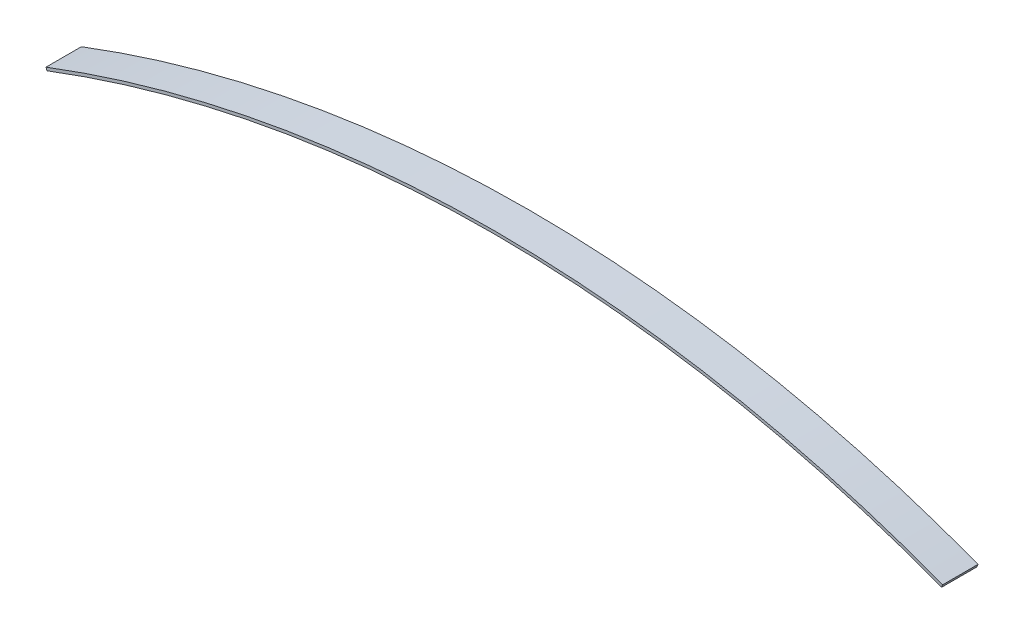
ISO-10303-21;
HEADER;
FILE_DESCRIPTION(('STEP AP214'),'2;1');
FILE_NAME('part.step','',(''),(''),'','','');
FILE_SCHEMA(('AUTOMOTIVE_DESIGN { 1 0 10303 214 1 1 1 1 }'));
ENDSEC;
DATA;
#1=APPLICATION_CONTEXT('core data for automotive mechanical design processes');
#2=APPLICATION_PROTOCOL_DEFINITION('international standard','automotive_design',2000,#1);
#3=PRODUCT_CONTEXT('',#1,'mechanical');
#4=PRODUCT('Part','Part','',(#3));
#5=PRODUCT_RELATED_PRODUCT_CATEGORY('part','',(#4));
#6=PRODUCT_DEFINITION_FORMATION('','',#4);
#7=PRODUCT_DEFINITION_CONTEXT('part definition',#1,'design');
#8=PRODUCT_DEFINITION('design','',#6,#7);
#9=PRODUCT_DEFINITION_SHAPE('','',#8);
#10=(LENGTH_UNIT() NAMED_UNIT(*) SI_UNIT(.MILLI.,.METRE.));
#11=(NAMED_UNIT(*) PLANE_ANGLE_UNIT() SI_UNIT($,.RADIAN.));
#12=(NAMED_UNIT(*) SI_UNIT($,.STERADIAN.) SOLID_ANGLE_UNIT());
#13=UNCERTAINTY_MEASURE_WITH_UNIT(LENGTH_MEASURE(1.E-05),#10,'distance_accuracy_value','');
#14=(GEOMETRIC_REPRESENTATION_CONTEXT(3) GLOBAL_UNCERTAINTY_ASSIGNED_CONTEXT((#13)) GLOBAL_UNIT_ASSIGNED_CONTEXT((#10,
#11,#12)) REPRESENTATION_CONTEXT('',''));
#15=CARTESIAN_POINT('',(0.,0.,0.));
#16=DIRECTION('',(0.,0.,1.));
#17=DIRECTION('',(1.,0.,0.));
#18=AXIS2_PLACEMENT_3D('',#15,#16,#17);
#19=CARTESIAN_POINT('',(0.,0.,0.));
#20=DIRECTION('',(0.,0.,1.));
#21=DIRECTION('',(1.,0.,0.));
#22=AXIS2_PLACEMENT_3D('',#19,#20,#21);
#23=CYLINDRICAL_SURFACE('',#22,2805.8);
#24=CARTESIAN_POINT('',(0.,0.,39.5));
#25=DIRECTION('',(0.,0.,1.));
#26=DIRECTION('',(1.,0.,0.));
#27=AXIS2_PLACEMENT_3D('',#24,#25,#26);
#28=CIRCLE('',#27,2805.8);
#29=CARTESIAN_POINT('',(998.90686566693,2621.96466675725,39.5));
#30=VERTEX_POINT('',#29);
#31=CARTESIAN_POINT('',(-998.90686566693,2621.96466675725,39.5));
#32=VERTEX_POINT('',#31);
#33=EDGE_CURVE('E11',#30,#32,#28,.T.);
#34=ORIENTED_EDGE('',*,*,#33,.T.);
#35=DIRECTION('',(0.,0.,1.));
#36=VECTOR('',#35,1.);
#37=CARTESIAN_POINT('',(-998.90686566693,2621.96466675725,39.5));
#38=LINE('',#37,#36);
#39=CARTESIAN_POINT('',(-998.90686566693,2621.96466675725,-39.5));
#40=VERTEX_POINT('',#39);
#41=EDGE_CURVE('E73',#40,#32,#38,.T.);
#42=ORIENTED_EDGE('',*,*,#41,.F.);
#43=CARTESIAN_POINT('',(0.,0.,-39.5));
#44=DIRECTION('',(0.,0.,1.));
#45=DIRECTION('',(1.,0.,0.));
#46=AXIS2_PLACEMENT_3D('',#43,#44,#45);
#47=CIRCLE('',#46,2805.8);
#48=CARTESIAN_POINT('',(998.90686566693,2621.96466675725,-39.5));
#49=VERTEX_POINT('',#48);
#50=EDGE_CURVE('E48',#49,#40,#47,.T.);
#51=ORIENTED_EDGE('',*,*,#50,.F.);
#52=DIRECTION('',(0.,0.,1.));
#53=VECTOR('',#52,1.);
#54=CARTESIAN_POINT('',(998.90686566693,2621.96466675725,39.5));
#55=LINE('',#54,#53);
#56=EDGE_CURVE('E75',#49,#30,#55,.T.);
#57=ORIENTED_EDGE('',*,*,#56,.T.);
#58=EDGE_LOOP('',(#34,#42,#51,#57));
#59=FACE_BOUND('',#58,.T.);
#60=ADVANCED_FACE('F33',(#59),#23,.F.);
#61=CARTESIAN_POINT('',(1001.18536161827,2627.94534031461,39.5));
#62=DIRECTION('',(0.,0.,1.));
#63=DIRECTION('',(1.,0.,0.));
#64=AXIS2_PLACEMENT_3D('',#61,#62,#63);
#65=PLANE('',#64);
#66=CARTESIAN_POINT('',(0.,0.,39.5));
#67=DIRECTION('',(0.,0.,1.));
#68=DIRECTION('',(1.,0.,0.));
#69=AXIS2_PLACEMENT_3D('',#66,#67,#68);
#70=CIRCLE('',#69,2812.2);
#71=CARTESIAN_POINT('',(1001.18536161827,2627.94534031461,39.5));
#72=VERTEX_POINT('',#71);
#73=CARTESIAN_POINT('',(-1001.18536161827,2627.94534031461,39.5));
#74=VERTEX_POINT('',#73);
#75=EDGE_CURVE('E41',#72,#74,#70,.T.);
#76=ORIENTED_EDGE('',*,*,#75,.T.);
#77=DIRECTION('',(-0.3560149923968,0.934480243337817,0.));
#78=VECTOR('',#77,1.);
#79=CARTESIAN_POINT('',(-1001.18536161827,2627.94534031461,39.5));
#80=LINE('',#79,#78);
#81=EDGE_CURVE('E84',#32,#74,#80,.T.);
#82=ORIENTED_EDGE('',*,*,#81,.F.);
#83=ORIENTED_EDGE('',*,*,#33,.F.);
#84=DIRECTION('',(0.356014992396792,0.93448024333782,0.));
#85=VECTOR('',#84,1.);
#86=CARTESIAN_POINT('',(1001.18536161827,2627.94534031461,39.5));
#87=LINE('',#86,#85);
#88=EDGE_CURVE('E94',#30,#72,#87,.T.);
#89=ORIENTED_EDGE('',*,*,#88,.T.);
#90=EDGE_LOOP('',(#76,#82,#83,#89));
#91=FACE_BOUND('',#90,.T.);
#92=ADVANCED_FACE('F35',(#91),#65,.T.);
#93=CARTESIAN_POINT('',(0.,0.,0.));
#94=DIRECTION('',(0.,0.,1.));
#95=DIRECTION('',(1.,0.,0.));
#96=AXIS2_PLACEMENT_3D('',#93,#94,#95);
#97=CYLINDRICAL_SURFACE('',#96,2812.2);
#98=CARTESIAN_POINT('',(0.,0.,-39.5));
#99=DIRECTION('',(0.,0.,1.));
#100=DIRECTION('',(1.,0.,0.));
#101=AXIS2_PLACEMENT_3D('',#98,#99,#100);
#102=CIRCLE('',#101,2812.2);
#103=CARTESIAN_POINT('',(1001.18536161827,2627.94534031461,-39.5));
#104=VERTEX_POINT('',#103);
#105=CARTESIAN_POINT('',(-1001.18536161827,2627.94534031461,-39.5));
#106=VERTEX_POINT('',#105);
#107=EDGE_CURVE('E56',#104,#106,#102,.T.);
#108=ORIENTED_EDGE('',*,*,#107,.T.);
#109=DIRECTION('',(0.,0.,-1.));
#110=VECTOR('',#109,1.);
#111=CARTESIAN_POINT('',(-1001.18536161827,2627.94534031461,39.5));
#112=LINE('',#111,#110);
#113=EDGE_CURVE('E88',#74,#106,#112,.T.);
#114=ORIENTED_EDGE('',*,*,#113,.F.);
#115=ORIENTED_EDGE('',*,*,#75,.F.);
#116=DIRECTION('',(0.,0.,-1.));
#117=VECTOR('',#116,1.);
#118=CARTESIAN_POINT('',(1001.18536161827,2627.94534031461,39.5));
#119=LINE('',#118,#117);
#120=EDGE_CURVE('E96',#72,#104,#119,.T.);
#121=ORIENTED_EDGE('',*,*,#120,.T.);
#122=EDGE_LOOP('',(#108,#114,#115,#121));
#123=FACE_BOUND('',#122,.T.);
#124=ADVANCED_FACE('F102',(#123),#97,.T.);
#125=CARTESIAN_POINT('',(1001.18536161827,2627.94534031461,-39.5));
#126=DIRECTION('',(0.,0.,-1.));
#127=DIRECTION('',(-1.,0.,0.));
#128=AXIS2_PLACEMENT_3D('',#125,#126,#127);
#129=PLANE('',#128);
#130=DIRECTION('',(-0.356014992396792,-0.93448024333782,0.));
#131=VECTOR('',#130,1.);
#132=CARTESIAN_POINT('',(1001.18536161827,2627.94534031461,-39.5));
#133=LINE('',#132,#131);
#134=EDGE_CURVE('E98',#104,#49,#133,.T.);
#135=ORIENTED_EDGE('',*,*,#134,.T.);
#136=ORIENTED_EDGE('',*,*,#50,.T.);
#137=DIRECTION('',(0.3560149923968,-0.934480243337817,0.));
#138=VECTOR('',#137,1.);
#139=CARTESIAN_POINT('',(-1001.18536161827,2627.94534031461,-39.5));
#140=LINE('',#139,#138);
#141=EDGE_CURVE('E86',#106,#40,#140,.T.);
#142=ORIENTED_EDGE('',*,*,#141,.F.);
#143=ORIENTED_EDGE('',*,*,#107,.F.);
#144=EDGE_LOOP('',(#135,#136,#142,#143));
#145=FACE_BOUND('',#144,.T.);
#146=ADVANCED_FACE('F105',(#145),#129,.T.);
#147=CARTESIAN_POINT('',(1.14122963043206E-11,-4.34781645837735E-12,0.));
#148=DIRECTION('',(-0.934480243337821,0.356014992396792,0.));
#149=DIRECTION('',(-0.356014992396792,-0.934480243337821,0.));
#150=AXIS2_PLACEMENT_3D('',#147,#148,#149);
#151=PLANE('',#150);
#152=ORIENTED_EDGE('',*,*,#56,.F.);
#153=ORIENTED_EDGE('',*,*,#134,.F.);
#154=ORIENTED_EDGE('',*,*,#120,.F.);
#155=ORIENTED_EDGE('',*,*,#88,.F.);
#156=EDGE_LOOP('',(#152,#153,#154,#155));
#157=FACE_BOUND('',#156,.T.);
#158=ADVANCED_FACE('F107',(#157),#151,.F.);
#159=CARTESIAN_POINT('',(1.14122963043206E-11,4.34781645837745E-12,0.));
#160=DIRECTION('',(-0.934480243337818,-0.3560149923968,0.));
#161=DIRECTION('',(0.3560149923968,-0.934480243337818,0.));
#162=AXIS2_PLACEMENT_3D('',#159,#160,#161);
#163=PLANE('',#162);
#164=ORIENTED_EDGE('',*,*,#41,.T.);
#165=ORIENTED_EDGE('',*,*,#81,.T.);
#166=ORIENTED_EDGE('',*,*,#113,.T.);
#167=ORIENTED_EDGE('',*,*,#141,.T.);
#168=EDGE_LOOP('',(#164,#165,#166,#167));
#169=FACE_BOUND('',#168,.T.);
#170=ADVANCED_FACE('F82',(#169),#163,.T.);
#171=CLOSED_SHELL('',(#60,#92,#124,#146,#158,#170));
#172=MANIFOLD_SOLID_BREP('B2',#171);
#173=ADVANCED_BREP_SHAPE_REPRESENTATION('',(#18,#172),#14);
#174=SHAPE_DEFINITION_REPRESENTATION(#9,#173);
ENDSEC;
END-ISO-10303-21;
